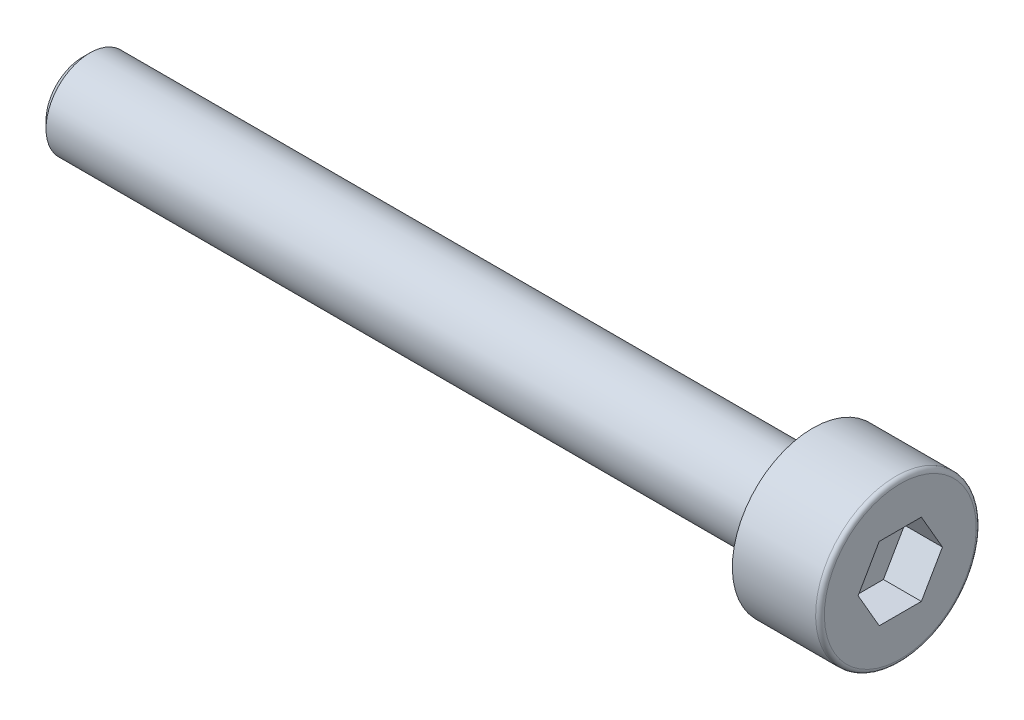
ISO-10303-21;
HEADER;
FILE_DESCRIPTION(('STEP AP214'),'2;1');
FILE_NAME('part.step','',(''),(''),'','','');
FILE_SCHEMA(('AUTOMOTIVE_DESIGN { 1 0 10303 214 1 1 1 1 }'));
ENDSEC;
DATA;
#1=APPLICATION_CONTEXT('core data for automotive mechanical design processes');
#2=APPLICATION_PROTOCOL_DEFINITION('international standard','automotive_design',2000,#1);
#3=PRODUCT_CONTEXT('',#1,'mechanical');
#4=PRODUCT('Part','Part','',(#3));
#5=PRODUCT_RELATED_PRODUCT_CATEGORY('part','',(#4));
#6=PRODUCT_DEFINITION_FORMATION('','',#4);
#7=PRODUCT_DEFINITION_CONTEXT('part definition',#1,'design');
#8=PRODUCT_DEFINITION('design','',#6,#7);
#9=PRODUCT_DEFINITION_SHAPE('','',#8);
#10=(LENGTH_UNIT() NAMED_UNIT(*) SI_UNIT(.MILLI.,.METRE.));
#11=(NAMED_UNIT(*) PLANE_ANGLE_UNIT() SI_UNIT($,.RADIAN.));
#12=(NAMED_UNIT(*) SI_UNIT($,.STERADIAN.) SOLID_ANGLE_UNIT());
#13=UNCERTAINTY_MEASURE_WITH_UNIT(LENGTH_MEASURE(1.E-05),#10,'distance_accuracy_value','');
#14=(GEOMETRIC_REPRESENTATION_CONTEXT(3) GLOBAL_UNCERTAINTY_ASSIGNED_CONTEXT((#13)) GLOBAL_UNIT_ASSIGNED_CONTEXT((#10,
#11,#12)) REPRESENTATION_CONTEXT('',''));
#15=CARTESIAN_POINT('',(0.,0.,0.));
#16=DIRECTION('',(0.,0.,1.));
#17=DIRECTION('',(1.,0.,0.));
#18=AXIS2_PLACEMENT_3D('',#15,#16,#17);
#19=CARTESIAN_POINT('',(0.,0.,0.));
#20=DIRECTION('',(1.,0.,0.));
#21=DIRECTION('',(0.,1.,0.));
#22=AXIS2_PLACEMENT_3D('',#19,#20,#21);
#23=PLANE('',#22);
#24=DIRECTION('',(0.,-0.866025403784439,0.5));
#25=VECTOR('',#24,1.);
#26=CARTESIAN_POINT('',(0.,1.25,0.721687836487035));
#27=LINE('',#26,#25);
#28=CARTESIAN_POINT('',(0.,1.25,0.721687836487035));
#29=VERTEX_POINT('',#28);
#30=CARTESIAN_POINT('',(0.,0.,1.44337567297407));
#31=VERTEX_POINT('',#30);
#32=EDGE_CURVE('E30',#29,#31,#27,.T.);
#33=ORIENTED_EDGE('',*,*,#32,.F.);
#34=DIRECTION('',(0.,0.,1.));
#35=VECTOR('',#34,1.);
#36=CARTESIAN_POINT('',(0.,1.25,-0.721687836487035));
#37=LINE('',#36,#35);
#38=CARTESIAN_POINT('',(0.,1.25,-0.721687836487035));
#39=VERTEX_POINT('',#38);
#40=EDGE_CURVE('E113',#39,#29,#37,.T.);
#41=ORIENTED_EDGE('',*,*,#40,.F.);
#42=DIRECTION('',(0.,0.866025403784439,0.5));
#43=VECTOR('',#42,1.);
#44=CARTESIAN_POINT('',(0.,0.,-1.44337567297406));
#45=LINE('',#44,#43);
#46=CARTESIAN_POINT('',(0.,0.,-1.44337567297406));
#47=VERTEX_POINT('',#46);
#48=EDGE_CURVE('E111',#47,#39,#45,.T.);
#49=ORIENTED_EDGE('',*,*,#48,.F.);
#50=DIRECTION('',(0.,0.866025403784439,-0.5));
#51=VECTOR('',#50,1.);
#52=CARTESIAN_POINT('',(0.,-1.25,-0.721687836487029));
#53=LINE('',#52,#51);
#54=CARTESIAN_POINT('',(0.,-1.25,-0.721687836487029));
#55=VERTEX_POINT('',#54);
#56=EDGE_CURVE('E78',#55,#47,#53,.T.);
#57=ORIENTED_EDGE('',*,*,#56,.F.);
#58=DIRECTION('',(0.,0.,-1.));
#59=VECTOR('',#58,1.);
#60=CARTESIAN_POINT('',(0.,-1.25,0.721687836487035));
#61=LINE('',#60,#59);
#62=CARTESIAN_POINT('',(0.,-1.25,0.721687836487035));
#63=VERTEX_POINT('',#62);
#64=EDGE_CURVE('E107',#63,#55,#61,.T.);
#65=ORIENTED_EDGE('',*,*,#64,.F.);
#66=DIRECTION('',(0.,-0.866025403784439,-0.5));
#67=VECTOR('',#66,1.);
#68=CARTESIAN_POINT('',(0.,0.,1.44337567297407));
#69=LINE('',#68,#67);
#70=EDGE_CURVE('E104',#31,#63,#69,.T.);
#71=ORIENTED_EDGE('',*,*,#70,.F.);
#72=EDGE_LOOP('',(#33,#41,#49,#57,#65,#71));
#73=FACE_BOUND('',#72,.T.);
#74=CARTESIAN_POINT('',(0.,0.,0.));
#75=DIRECTION('',(1.,0.,0.));
#76=DIRECTION('',(0.,1.,0.));
#77=AXIS2_PLACEMENT_3D('',#74,#75,#76);
#78=CIRCLE('',#77,2.6);
#79=CARTESIAN_POINT('',(0.,2.6,0.));
#80=VERTEX_POINT('',#79);
#81=EDGE_CURVE('E131',#80,#80,#78,.T.);
#82=ORIENTED_EDGE('',*,*,#81,.T.);
#83=EDGE_LOOP('',(#82));
#84=FACE_BOUND('',#83,.T.);
#85=ADVANCED_FACE('F15',(#73,#84),#23,.T.);
#86=CARTESIAN_POINT('',(-0.15,0.,0.));
#87=DIRECTION('',(1.,0.,0.));
#88=DIRECTION('',(0.,1.,0.));
#89=AXIS2_PLACEMENT_3D('',#86,#87,#88);
#90=TOROIDAL_SURFACE('',#89,2.6,0.15);
#91=CARTESIAN_POINT('',(-0.15,0.,0.));
#92=DIRECTION('',(1.,0.,0.));
#93=DIRECTION('',(0.,1.,0.));
#94=AXIS2_PLACEMENT_3D('',#91,#92,#93);
#95=CIRCLE('',#94,2.75);
#96=CARTESIAN_POINT('',(-0.15,2.75,0.));
#97=VERTEX_POINT('',#96);
#98=EDGE_CURVE('E128',#97,#97,#95,.T.);
#99=ORIENTED_EDGE('',*,*,#98,.T.);
#100=EDGE_LOOP('',(#99));
#101=FACE_BOUND('',#100,.T.);
#102=ORIENTED_EDGE('',*,*,#81,.F.);
#103=EDGE_LOOP('',(#102));
#104=FACE_BOUND('',#103,.T.);
#105=ADVANCED_FACE('F150',(#101,#104),#90,.T.);
#106=CARTESIAN_POINT('',(0.,0.,0.));
#107=DIRECTION('',(1.,0.,0.));
#108=DIRECTION('',(0.,1.,0.));
#109=AXIS2_PLACEMENT_3D('',#106,#107,#108);
#110=CYLINDRICAL_SURFACE('',#109,2.75);
#111=CARTESIAN_POINT('',(-3.,0.,0.));
#112=DIRECTION('',(1.,0.,0.));
#113=DIRECTION('',(0.,1.,0.));
#114=AXIS2_PLACEMENT_3D('',#111,#112,#113);
#115=CIRCLE('',#114,2.75);
#116=CARTESIAN_POINT('',(-3.,2.75,0.));
#117=VERTEX_POINT('',#116);
#118=EDGE_CURVE('E125',#117,#117,#115,.T.);
#119=ORIENTED_EDGE('',*,*,#118,.T.);
#120=EDGE_LOOP('',(#119));
#121=FACE_BOUND('',#120,.T.);
#122=ORIENTED_EDGE('',*,*,#98,.F.);
#123=EDGE_LOOP('',(#122));
#124=FACE_BOUND('',#123,.T.);
#125=ADVANCED_FACE('F156',(#121,#124),#110,.T.);
#126=CARTESIAN_POINT('',(-3.,2.75,0.));
#127=DIRECTION('',(-1.,0.,0.));
#128=DIRECTION('',(0.,-1.,0.));
#129=AXIS2_PLACEMENT_3D('',#126,#127,#128);
#130=PLANE('',#129);
#131=CARTESIAN_POINT('',(-3.,0.,0.));
#132=DIRECTION('',(1.,0.,0.));
#133=DIRECTION('',(0.,1.,0.));
#134=AXIS2_PLACEMENT_3D('',#131,#132,#133);
#135=CIRCLE('',#134,1.5);
#136=CARTESIAN_POINT('',(-3.,1.5,0.));
#137=VERTEX_POINT('',#136);
#138=EDGE_CURVE('E117',#137,#137,#135,.T.);
#139=ORIENTED_EDGE('',*,*,#138,.T.);
#140=EDGE_LOOP('',(#139));
#141=FACE_BOUND('',#140,.T.);
#142=ORIENTED_EDGE('',*,*,#118,.F.);
#143=EDGE_LOOP('',(#142));
#144=FACE_BOUND('',#143,.T.);
#145=ADVANCED_FACE('F163',(#141,#144),#130,.T.);
#146=CARTESIAN_POINT('',(0.,0.,0.));
#147=DIRECTION('',(1.,0.,0.));
#148=DIRECTION('',(0.,1.,0.));
#149=AXIS2_PLACEMENT_3D('',#146,#147,#148);
#150=CYLINDRICAL_SURFACE('',#149,1.5);
#151=CARTESIAN_POINT('',(-27.75,0.,0.));
#152=DIRECTION('',(-1.,0.,0.));
#153=DIRECTION('',(0.,-1.,0.));
#154=AXIS2_PLACEMENT_3D('',#151,#152,#153);
#155=CIRCLE('',#154,1.5);
#156=CARTESIAN_POINT('',(-27.75,-1.5,0.));
#157=VERTEX_POINT('',#156);
#158=EDGE_CURVE('E23',#157,#157,#155,.F.);
#159=ORIENTED_EDGE('',*,*,#158,.T.);
#160=EDGE_LOOP('',(#159));
#161=FACE_BOUND('',#160,.T.);
#162=ORIENTED_EDGE('',*,*,#138,.F.);
#163=EDGE_LOOP('',(#162));
#164=FACE_BOUND('',#163,.T.);
#165=ADVANCED_FACE('F136',(#161,#164),#150,.T.);
#166=CARTESIAN_POINT('',(-28.,1.5,0.));
#167=DIRECTION('',(-1.,0.,0.));
#168=DIRECTION('',(0.,-1.,0.));
#169=AXIS2_PLACEMENT_3D('',#166,#167,#168);
#170=PLANE('',#169);
#171=CARTESIAN_POINT('',(-28.,0.,0.));
#172=DIRECTION('',(-1.,0.,0.));
#173=DIRECTION('',(0.,-1.,0.));
#174=AXIS2_PLACEMENT_3D('',#171,#172,#173);
#175=CIRCLE('',#174,1.25);
#176=CARTESIAN_POINT('',(-28.,-1.25,0.));
#177=VERTEX_POINT('',#176);
#178=EDGE_CURVE('E9',#177,#177,#175,.T.);
#179=ORIENTED_EDGE('',*,*,#178,.T.);
#180=EDGE_LOOP('',(#179));
#181=FACE_BOUND('',#180,.T.);
#182=ADVANCED_FACE('F170',(#181),#170,.T.);
#183=CARTESIAN_POINT('',(-1.3,1.25,0.721687836487035));
#184=DIRECTION('',(0.,0.5,0.866025403784439));
#185=DIRECTION('',(0.,-0.866025403784439,0.5));
#186=AXIS2_PLACEMENT_3D('',#183,#184,#185);
#187=PLANE('',#186);
#188=ORIENTED_EDGE('',*,*,#32,.T.);
#189=DIRECTION('',(1.,0.,0.));
#190=VECTOR('',#189,1.);
#191=CARTESIAN_POINT('',(-1.3,0.,1.44337567297407));
#192=LINE('',#191,#190);
#193=CARTESIAN_POINT('',(-1.3,0.,1.44337567297407));
#194=VERTEX_POINT('',#193);
#195=EDGE_CURVE('E60',#194,#31,#192,.T.);
#196=ORIENTED_EDGE('',*,*,#195,.F.);
#197=DIRECTION('',(0.,-0.866025403784439,0.5));
#198=VECTOR('',#197,1.);
#199=CARTESIAN_POINT('',(-1.3,1.25,0.721687836487035));
#200=LINE('',#199,#198);
#201=CARTESIAN_POINT('',(-1.3,1.25,0.721687836487035));
#202=VERTEX_POINT('',#201);
#203=EDGE_CURVE('E115',#202,#194,#200,.T.);
#204=ORIENTED_EDGE('',*,*,#203,.F.);
#205=DIRECTION('',(1.,0.,0.));
#206=VECTOR('',#205,1.);
#207=CARTESIAN_POINT('',(-1.3,1.25,0.721687836487035));
#208=LINE('',#207,#206);
#209=EDGE_CURVE('E38',#202,#29,#208,.T.);
#210=ORIENTED_EDGE('',*,*,#209,.T.);
#211=EDGE_LOOP('',(#188,#196,#204,#210));
#212=FACE_BOUND('',#211,.T.);
#213=ADVANCED_FACE('F173',(#212),#187,.F.);
#214=CARTESIAN_POINT('',(-1.3,1.25,-0.721687836487035));
#215=DIRECTION('',(0.,1.,0.));
#216=DIRECTION('',(-1.,0.,0.));
#217=AXIS2_PLACEMENT_3D('',#214,#215,#216);
#218=PLANE('',#217);
#219=ORIENTED_EDGE('',*,*,#40,.T.);
#220=ORIENTED_EDGE('',*,*,#209,.F.);
#221=DIRECTION('',(0.,0.,1.));
#222=VECTOR('',#221,1.);
#223=CARTESIAN_POINT('',(-1.3,1.25,-0.721687836487035));
#224=LINE('',#223,#222);
#225=CARTESIAN_POINT('',(-1.3,1.25,-0.721687836487035));
#226=VERTEX_POINT('',#225);
#227=EDGE_CURVE('E90',#226,#202,#224,.T.);
#228=ORIENTED_EDGE('',*,*,#227,.F.);
#229=DIRECTION('',(1.,0.,0.));
#230=VECTOR('',#229,1.);
#231=CARTESIAN_POINT('',(-1.3,1.25,-0.721687836487035));
#232=LINE('',#231,#230);
#233=EDGE_CURVE('E82',#226,#39,#232,.T.);
#234=ORIENTED_EDGE('',*,*,#233,.T.);
#235=EDGE_LOOP('',(#219,#220,#228,#234));
#236=FACE_BOUND('',#235,.T.);
#237=ADVANCED_FACE('F177',(#236),#218,.F.);
#238=CARTESIAN_POINT('',(-1.3,0.,-1.44337567297406));
#239=DIRECTION('',(0.,0.5,-0.866025403784439));
#240=DIRECTION('',(0.,0.866025403784439,0.5));
#241=AXIS2_PLACEMENT_3D('',#238,#239,#240);
#242=PLANE('',#241);
#243=ORIENTED_EDGE('',*,*,#48,.T.);
#244=ORIENTED_EDGE('',*,*,#233,.F.);
#245=DIRECTION('',(0.,0.866025403784439,0.5));
#246=VECTOR('',#245,1.);
#247=CARTESIAN_POINT('',(-1.3,0.,-1.44337567297406));
#248=LINE('',#247,#246);
#249=CARTESIAN_POINT('',(-1.3,0.,-1.44337567297406));
#250=VERTEX_POINT('',#249);
#251=EDGE_CURVE('E86',#250,#226,#248,.T.);
#252=ORIENTED_EDGE('',*,*,#251,.F.);
#253=DIRECTION('',(1.,0.,0.));
#254=VECTOR('',#253,1.);
#255=CARTESIAN_POINT('',(-1.3,0.,-1.44337567297406));
#256=LINE('',#255,#254);
#257=EDGE_CURVE('E71',#250,#47,#256,.T.);
#258=ORIENTED_EDGE('',*,*,#257,.T.);
#259=EDGE_LOOP('',(#243,#244,#252,#258));
#260=FACE_BOUND('',#259,.T.);
#261=ADVANCED_FACE('F87',(#260),#242,.F.);
#262=CARTESIAN_POINT('',(-1.3,-1.25,-0.721687836487029));
#263=DIRECTION('',(0.,-0.5,-0.866025403784439));
#264=DIRECTION('',(0.,0.866025403784439,-0.5));
#265=AXIS2_PLACEMENT_3D('',#262,#263,#264);
#266=PLANE('',#265);
#267=ORIENTED_EDGE('',*,*,#56,.T.);
#268=ORIENTED_EDGE('',*,*,#257,.F.);
#269=DIRECTION('',(0.,0.866025403784439,-0.5));
#270=VECTOR('',#269,1.);
#271=CARTESIAN_POINT('',(-1.3,-1.25,-0.721687836487029));
#272=LINE('',#271,#270);
#273=CARTESIAN_POINT('',(-1.3,-1.25,-0.721687836487029));
#274=VERTEX_POINT('',#273);
#275=EDGE_CURVE('E75',#274,#250,#272,.T.);
#276=ORIENTED_EDGE('',*,*,#275,.F.);
#277=DIRECTION('',(1.,0.,0.));
#278=VECTOR('',#277,1.);
#279=CARTESIAN_POINT('',(-1.3,-1.25,-0.721687836487029));
#280=LINE('',#279,#278);
#281=EDGE_CURVE('E83',#274,#55,#280,.T.);
#282=ORIENTED_EDGE('',*,*,#281,.T.);
#283=EDGE_LOOP('',(#267,#268,#276,#282));
#284=FACE_BOUND('',#283,.T.);
#285=ADVANCED_FACE('F73',(#284),#266,.F.);
#286=CARTESIAN_POINT('',(-1.3,-1.25,0.721687836487035));
#287=DIRECTION('',(0.,-1.,0.));
#288=DIRECTION('',(0.,0.,-1.));
#289=AXIS2_PLACEMENT_3D('',#286,#287,#288);
#290=PLANE('',#289);
#291=ORIENTED_EDGE('',*,*,#64,.T.);
#292=ORIENTED_EDGE('',*,*,#281,.F.);
#293=DIRECTION('',(0.,0.,-1.));
#294=VECTOR('',#293,1.);
#295=CARTESIAN_POINT('',(-1.3,-1.25,0.721687836487035));
#296=LINE('',#295,#294);
#297=CARTESIAN_POINT('',(-1.3,-1.25,0.721687836487035));
#298=VERTEX_POINT('',#297);
#299=EDGE_CURVE('E96',#298,#274,#296,.T.);
#300=ORIENTED_EDGE('',*,*,#299,.F.);
#301=DIRECTION('',(1.,0.,0.));
#302=VECTOR('',#301,1.);
#303=CARTESIAN_POINT('',(-1.3,-1.25,0.721687836487035));
#304=LINE('',#303,#302);
#305=EDGE_CURVE('E120',#298,#63,#304,.T.);
#306=ORIENTED_EDGE('',*,*,#305,.T.);
#307=EDGE_LOOP('',(#291,#292,#300,#306));
#308=FACE_BOUND('',#307,.T.);
#309=ADVANCED_FACE('F180',(#308),#290,.F.);
#310=CARTESIAN_POINT('',(-1.3,0.,1.44337567297407));
#311=DIRECTION('',(0.,-0.5,0.866025403784439));
#312=DIRECTION('',(0.,-0.866025403784439,-0.5));
#313=AXIS2_PLACEMENT_3D('',#310,#311,#312);
#314=PLANE('',#313);
#315=ORIENTED_EDGE('',*,*,#70,.T.);
#316=ORIENTED_EDGE('',*,*,#305,.F.);
#317=DIRECTION('',(0.,-0.866025403784439,-0.5));
#318=VECTOR('',#317,1.);
#319=CARTESIAN_POINT('',(-1.3,0.,1.44337567297407));
#320=LINE('',#319,#318);
#321=EDGE_CURVE('E98',#194,#298,#320,.T.);
#322=ORIENTED_EDGE('',*,*,#321,.F.);
#323=ORIENTED_EDGE('',*,*,#195,.T.);
#324=EDGE_LOOP('',(#315,#316,#322,#323));
#325=FACE_BOUND('',#324,.T.);
#326=ADVANCED_FACE('F146',(#325),#314,.F.);
#327=CARTESIAN_POINT('',(-1.3,0.,1.44337567297407));
#328=DIRECTION('',(1.,0.,0.));
#329=DIRECTION('',(0.,1.,0.));
#330=AXIS2_PLACEMENT_3D('',#327,#328,#329);
#331=PLANE('',#330);
#332=ORIENTED_EDGE('',*,*,#203,.T.);
#333=ORIENTED_EDGE('',*,*,#321,.T.);
#334=ORIENTED_EDGE('',*,*,#299,.T.);
#335=ORIENTED_EDGE('',*,*,#275,.T.);
#336=ORIENTED_EDGE('',*,*,#251,.T.);
#337=ORIENTED_EDGE('',*,*,#227,.T.);
#338=EDGE_LOOP('',(#332,#333,#334,#335,#336,#337));
#339=FACE_BOUND('',#338,.T.);
#340=ADVANCED_FACE('F93',(#339),#331,.T.);
#341=CARTESIAN_POINT('',(-27.75,0.,0.));
#342=DIRECTION('',(1.,0.,0.));
#343=DIRECTION('',(0.,1.,0.));
#344=AXIS2_PLACEMENT_3D('',#341,#342,#343);
#345=CONICAL_SURFACE('',#344,1.5,0.785398163397445);
#346=ORIENTED_EDGE('',*,*,#178,.F.);
#347=EDGE_LOOP('',(#346));
#348=FACE_BOUND('',#347,.T.);
#349=ORIENTED_EDGE('',*,*,#158,.F.);
#350=EDGE_LOOP('',(#349));
#351=FACE_BOUND('',#350,.T.);
#352=ADVANCED_FACE('F17',(#348,#351),#345,.T.);
#353=CLOSED_SHELL('',(#85,#105,#125,#145,#165,#182,#213,#237,#261,#285,#309,#326,#340,#352));
#354=MANIFOLD_SOLID_BREP('B1',#353);
#355=ADVANCED_BREP_SHAPE_REPRESENTATION('',(#18,#354),#14);
#356=SHAPE_DEFINITION_REPRESENTATION(#9,#355);
ENDSEC;
END-ISO-10303-21;
